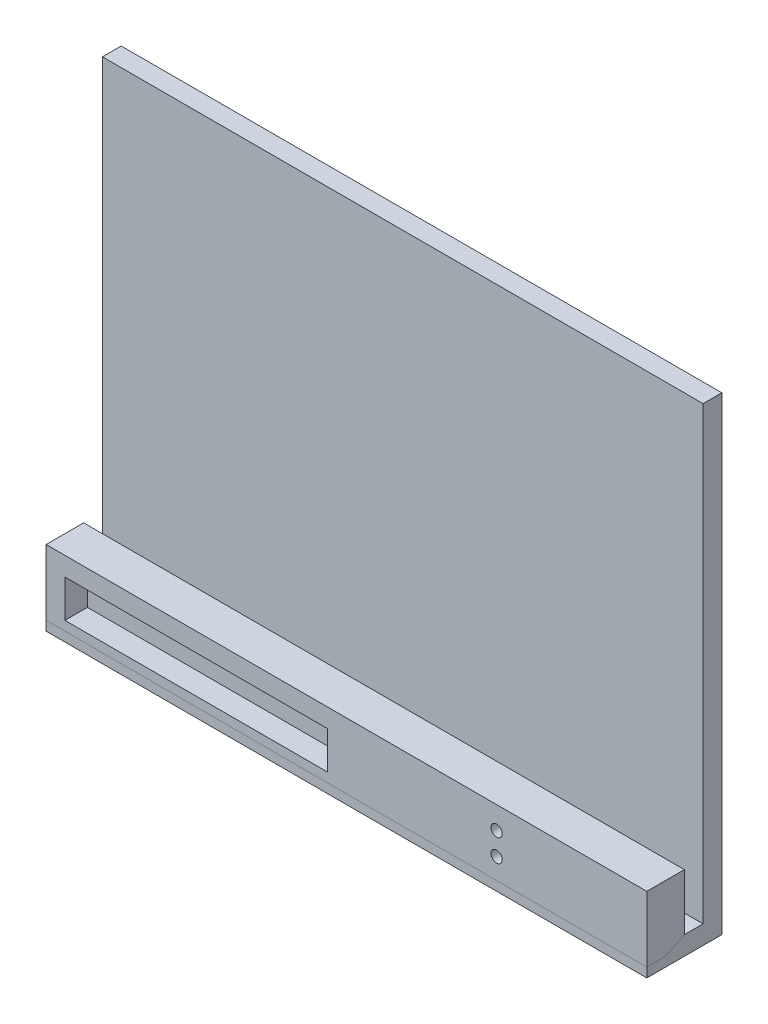
ISO-10303-21;
HEADER;
FILE_DESCRIPTION(('STEP AP214'),'2;1');
FILE_NAME('part.step','',(''),(''),'','','');
FILE_SCHEMA(('AUTOMOTIVE_DESIGN { 1 0 10303 214 1 1 1 1 }'));
ENDSEC;
DATA;
#1=APPLICATION_CONTEXT('core data for automotive mechanical design processes');
#2=APPLICATION_PROTOCOL_DEFINITION('international standard','automotive_design',2000,#1);
#3=PRODUCT_CONTEXT('',#1,'mechanical');
#4=PRODUCT('Part','Part','',(#3));
#5=PRODUCT_RELATED_PRODUCT_CATEGORY('part','',(#4));
#6=PRODUCT_DEFINITION_FORMATION('','',#4);
#7=PRODUCT_DEFINITION_CONTEXT('part definition',#1,'design');
#8=PRODUCT_DEFINITION('design','',#6,#7);
#9=PRODUCT_DEFINITION_SHAPE('','',#8);
#10=(LENGTH_UNIT() NAMED_UNIT(*) SI_UNIT(.MILLI.,.METRE.));
#11=(NAMED_UNIT(*) PLANE_ANGLE_UNIT() SI_UNIT($,.RADIAN.));
#12=(NAMED_UNIT(*) SI_UNIT($,.STERADIAN.) SOLID_ANGLE_UNIT());
#13=UNCERTAINTY_MEASURE_WITH_UNIT(LENGTH_MEASURE(1.E-05),#10,'distance_accuracy_value','');
#14=(GEOMETRIC_REPRESENTATION_CONTEXT(3) GLOBAL_UNCERTAINTY_ASSIGNED_CONTEXT((#13)) GLOBAL_UNIT_ASSIGNED_CONTEXT((#10,
#11,#12)) REPRESENTATION_CONTEXT('',''));
#15=CARTESIAN_POINT('',(0.,0.,0.));
#16=DIRECTION('',(0.,0.,1.));
#17=DIRECTION('',(1.,0.,0.));
#18=AXIS2_PLACEMENT_3D('',#15,#16,#17);
#19=CARTESIAN_POINT('',(-0.01000000000001,3.17499999999996,19.05));
#20=DIRECTION('',(0.,-0.894427190999916,-0.447213595499958));
#21=DIRECTION('',(0.,0.447213595499958,-0.894427190999916));
#22=AXIS2_PLACEMENT_3D('',#19,#20,#21);
#23=PLANE('',#22);
#24=DIRECTION('',(1.,0.,0.));
#25=VECTOR('',#24,1.);
#26=CARTESIAN_POINT('',(-0.01000000000001,3.17499999999996,19.05));
#27=LINE('',#26,#25);
#28=CARTESIAN_POINT('',(0.,3.17499999999995,19.05));
#29=VERTEX_POINT('',#28);
#30=CARTESIAN_POINT('',(203.2,3.17499999999998,19.05));
#31=VERTEX_POINT('',#30);
#32=EDGE_CURVE('E12',#29,#31,#27,.T.);
#33=ORIENTED_EDGE('',*,*,#32,.F.);
#34=DIRECTION('',(0.,0.447213595499958,-0.894427190999916));
#35=VECTOR('',#34,1.);
#36=CARTESIAN_POINT('',(0.,39.37,-53.34));
#37=LINE('',#36,#35);
#38=CARTESIAN_POINT('',(0.,6.35,12.7));
#39=VERTEX_POINT('',#38);
#40=EDGE_CURVE('E121',#29,#39,#37,.T.);
#41=ORIENTED_EDGE('',*,*,#40,.T.);
#42=DIRECTION('',(-1.,0.,0.));
#43=VECTOR('',#42,1.);
#44=CARTESIAN_POINT('',(0.,6.35,12.7));
#45=LINE('',#44,#43);
#46=CARTESIAN_POINT('',(203.2,6.35,12.7));
#47=VERTEX_POINT('',#46);
#48=EDGE_CURVE('E168',#47,#39,#45,.T.);
#49=ORIENTED_EDGE('',*,*,#48,.F.);
#50=DIRECTION('',(0.,-0.447213595499958,0.894427190999916));
#51=VECTOR('',#50,1.);
#52=CARTESIAN_POINT('',(203.2,39.37,-53.34));
#53=LINE('',#52,#51);
#54=EDGE_CURVE('E124',#47,#31,#53,.T.);
#55=ORIENTED_EDGE('',*,*,#54,.T.);
#56=EDGE_LOOP('',(#33,#41,#49,#55));
#57=FACE_BOUND('',#56,.T.);
#58=ADVANCED_FACE('F43',(#57),#23,.T.);
#59=CARTESIAN_POINT('',(-0.01000000000001,3.17499999999996,25.4));
#60=DIRECTION('',(0.,-1.,0.));
#61=DIRECTION('',(1.,0.,0.));
#62=AXIS2_PLACEMENT_3D('',#59,#60,#61);
#63=PLANE('',#62);
#64=DIRECTION('',(1.,0.,0.));
#65=VECTOR('',#64,1.);
#66=CARTESIAN_POINT('',(0.,3.17499999999996,25.4));
#67=LINE('',#66,#65);
#68=CARTESIAN_POINT('',(0.,3.17499999999998,25.4));
#69=VERTEX_POINT('',#68);
#70=CARTESIAN_POINT('',(203.2,3.17499999999998,25.4));
#71=VERTEX_POINT('',#70);
#72=EDGE_CURVE('E140',#69,#71,#67,.T.);
#73=ORIENTED_EDGE('',*,*,#72,.F.);
#74=DIRECTION('',(0.,0.,-1.));
#75=VECTOR('',#74,1.);
#76=CARTESIAN_POINT('',(0.,3.17499999999996,6.35));
#77=LINE('',#76,#75);
#78=EDGE_CURVE('E132',#69,#29,#77,.T.);
#79=ORIENTED_EDGE('',*,*,#78,.T.);
#80=ORIENTED_EDGE('',*,*,#32,.T.);
#81=DIRECTION('',(0.,0.,1.));
#82=VECTOR('',#81,1.);
#83=CARTESIAN_POINT('',(203.2,3.17499999999998,6.35));
#84=LINE('',#83,#82);
#85=EDGE_CURVE('E137',#31,#71,#84,.T.);
#86=ORIENTED_EDGE('',*,*,#85,.T.);
#87=EDGE_LOOP('',(#73,#79,#80,#86));
#88=FACE_BOUND('',#87,.T.);
#89=ADVANCED_FACE('F139',(#88),#63,.T.);
#90=CARTESIAN_POINT('',(0.,0.,17.78));
#91=DIRECTION('',(0.,0.,1.));
#92=DIRECTION('',(1.,0.,0.));
#93=AXIS2_PLACEMENT_3D('',#90,#91,#92);
#94=PLANE('',#93);
#95=DIRECTION('',(0.,-1.,0.));
#96=VECTOR('',#95,1.);
#97=CARTESIAN_POINT('',(6.35,19.05,17.78));
#98=LINE('',#97,#96);
#99=CARTESIAN_POINT('',(6.35,19.05,17.78));
#100=VERTEX_POINT('',#99);
#101=CARTESIAN_POINT('',(6.35,6.35,17.78));
#102=VERTEX_POINT('',#101);
#103=EDGE_CURVE('E178',#100,#102,#98,.T.);
#104=ORIENTED_EDGE('',*,*,#103,.T.);
#105=DIRECTION('',(1.,0.,0.));
#106=VECTOR('',#105,1.);
#107=CARTESIAN_POINT('',(6.35,6.35,17.78));
#108=LINE('',#107,#106);
#109=CARTESIAN_POINT('',(95.25,6.35,17.78));
#110=VERTEX_POINT('',#109);
#111=EDGE_CURVE('E190',#102,#110,#108,.T.);
#112=ORIENTED_EDGE('',*,*,#111,.T.);
#113=DIRECTION('',(0.,1.,0.));
#114=VECTOR('',#113,1.);
#115=CARTESIAN_POINT('',(95.25,19.05,17.78));
#116=LINE('',#115,#114);
#117=CARTESIAN_POINT('',(95.25,19.05,17.78));
#118=VERTEX_POINT('',#117);
#119=EDGE_CURVE('E187',#110,#118,#116,.T.);
#120=ORIENTED_EDGE('',*,*,#119,.T.);
#121=DIRECTION('',(-1.,0.,0.));
#122=VECTOR('',#121,1.);
#123=CARTESIAN_POINT('',(6.35,19.05,17.78));
#124=LINE('',#123,#122);
#125=EDGE_CURVE('E170',#118,#100,#124,.T.);
#126=ORIENTED_EDGE('',*,*,#125,.T.);
#127=EDGE_LOOP('',(#104,#112,#120,#126));
#128=FACE_BOUND('',#127,.T.);
#129=ADVANCED_FACE('F221',(#128),#94,.T.);
#130=CARTESIAN_POINT('',(6.35,6.35,17.78));
#131=DIRECTION('',(0.,-1.,0.));
#132=DIRECTION('',(0.,0.,-1.));
#133=AXIS2_PLACEMENT_3D('',#130,#131,#132);
#134=PLANE('',#133);
#135=DIRECTION('',(1.,0.,0.));
#136=VECTOR('',#135,1.);
#137=CARTESIAN_POINT('',(6.35,6.35,25.4));
#138=LINE('',#137,#136);
#139=CARTESIAN_POINT('',(6.35,6.35,25.4));
#140=VERTEX_POINT('',#139);
#141=CARTESIAN_POINT('',(95.25,6.35,25.4));
#142=VERTEX_POINT('',#141);
#143=EDGE_CURVE('E180',#140,#142,#138,.T.);
#144=ORIENTED_EDGE('',*,*,#143,.T.);
#145=DIRECTION('',(0.,0.,1.));
#146=VECTOR('',#145,1.);
#147=CARTESIAN_POINT('',(95.25,6.35,17.78));
#148=LINE('',#147,#146);
#149=EDGE_CURVE('E62',#110,#142,#148,.T.);
#150=ORIENTED_EDGE('',*,*,#149,.F.);
#151=ORIENTED_EDGE('',*,*,#111,.F.);
#152=DIRECTION('',(0.,0.,1.));
#153=VECTOR('',#152,1.);
#154=CARTESIAN_POINT('',(6.35,6.35,17.78));
#155=LINE('',#154,#153);
#156=EDGE_CURVE('E83',#102,#140,#155,.T.);
#157=ORIENTED_EDGE('',*,*,#156,.T.);
#158=EDGE_LOOP('',(#144,#150,#151,#157));
#159=FACE_BOUND('',#158,.T.);
#160=ADVANCED_FACE('F224',(#159),#134,.F.);
#161=CARTESIAN_POINT('',(95.25,19.05,17.78));
#162=DIRECTION('',(1.,0.,0.));
#163=DIRECTION('',(0.,0.,-1.));
#164=AXIS2_PLACEMENT_3D('',#161,#162,#163);
#165=PLANE('',#164);
#166=DIRECTION('',(0.,1.,0.));
#167=VECTOR('',#166,1.);
#168=CARTESIAN_POINT('',(95.25,19.05,25.4));
#169=LINE('',#168,#167);
#170=CARTESIAN_POINT('',(95.25,19.05,25.4));
#171=VERTEX_POINT('',#170);
#172=EDGE_CURVE('E177',#142,#171,#169,.T.);
#173=ORIENTED_EDGE('',*,*,#172,.T.);
#174=DIRECTION('',(0.,0.,1.));
#175=VECTOR('',#174,1.);
#176=CARTESIAN_POINT('',(95.25,19.05,17.78));
#177=LINE('',#176,#175);
#178=EDGE_CURVE('E172',#118,#171,#177,.T.);
#179=ORIENTED_EDGE('',*,*,#178,.F.);
#180=ORIENTED_EDGE('',*,*,#119,.F.);
#181=ORIENTED_EDGE('',*,*,#149,.T.);
#182=EDGE_LOOP('',(#173,#179,#180,#181));
#183=FACE_BOUND('',#182,.T.);
#184=ADVANCED_FACE('F230',(#183),#165,.F.);
#185=CARTESIAN_POINT('',(6.35,19.05,17.78));
#186=DIRECTION('',(0.,1.,0.));
#187=DIRECTION('',(0.,0.,1.));
#188=AXIS2_PLACEMENT_3D('',#185,#186,#187);
#189=PLANE('',#188);
#190=DIRECTION('',(-1.,0.,0.));
#191=VECTOR('',#190,1.);
#192=CARTESIAN_POINT('',(6.35,19.05,25.4));
#193=LINE('',#192,#191);
#194=CARTESIAN_POINT('',(6.35,19.05,25.4));
#195=VERTEX_POINT('',#194);
#196=EDGE_CURVE('E175',#171,#195,#193,.T.);
#197=ORIENTED_EDGE('',*,*,#196,.T.);
#198=DIRECTION('',(0.,0.,1.));
#199=VECTOR('',#198,1.);
#200=CARTESIAN_POINT('',(6.35,19.05,17.78));
#201=LINE('',#200,#199);
#202=EDGE_CURVE('E85',#100,#195,#201,.T.);
#203=ORIENTED_EDGE('',*,*,#202,.F.);
#204=ORIENTED_EDGE('',*,*,#125,.F.);
#205=ORIENTED_EDGE('',*,*,#178,.T.);
#206=EDGE_LOOP('',(#197,#203,#204,#205));
#207=FACE_BOUND('',#206,.T.);
#208=ADVANCED_FACE('F234',(#207),#189,.F.);
#209=CARTESIAN_POINT('',(6.35,19.05,17.78));
#210=DIRECTION('',(-1.,0.,0.));
#211=DIRECTION('',(0.,-1.,0.));
#212=AXIS2_PLACEMENT_3D('',#209,#210,#211);
#213=PLANE('',#212);
#214=DIRECTION('',(0.,-1.,0.));
#215=VECTOR('',#214,1.);
#216=CARTESIAN_POINT('',(6.35,19.05,25.4));
#217=LINE('',#216,#215);
#218=EDGE_CURVE('E182',#195,#140,#217,.T.);
#219=ORIENTED_EDGE('',*,*,#218,.T.);
#220=ORIENTED_EDGE('',*,*,#156,.F.);
#221=ORIENTED_EDGE('',*,*,#103,.F.);
#222=ORIENTED_EDGE('',*,*,#202,.T.);
#223=EDGE_LOOP('',(#219,#220,#221,#222));
#224=FACE_BOUND('',#223,.T.);
#225=ADVANCED_FACE('F247',(#224),#213,.F.);
#226=CARTESIAN_POINT('',(203.2,158.75,6.35));
#227=DIRECTION('',(-1.,0.,0.));
#228=DIRECTION('',(0.,-1.,0.));
#229=AXIS2_PLACEMENT_3D('',#226,#227,#228);
#230=PLANE('',#229);
#231=ORIENTED_EDGE('',*,*,#85,.F.);
#232=ORIENTED_EDGE('',*,*,#54,.F.);
#233=DIRECTION('',(0.,-1.,0.));
#234=VECTOR('',#233,1.);
#235=CARTESIAN_POINT('',(203.2,25.4,12.7));
#236=LINE('',#235,#234);
#237=CARTESIAN_POINT('',(203.2,25.4,12.7));
#238=VERTEX_POINT('',#237);
#239=EDGE_CURVE('E151',#238,#47,#236,.T.);
#240=ORIENTED_EDGE('',*,*,#239,.F.);
#241=DIRECTION('',(0.,0.,-1.));
#242=VECTOR('',#241,1.);
#243=CARTESIAN_POINT('',(203.2,25.4,25.4));
#244=LINE('',#243,#242);
#245=CARTESIAN_POINT('',(203.2,25.4,25.4));
#246=VERTEX_POINT('',#245);
#247=EDGE_CURVE('E161',#246,#238,#244,.T.);
#248=ORIENTED_EDGE('',*,*,#247,.F.);
#249=DIRECTION('',(0.,1.,0.));
#250=VECTOR('',#249,1.);
#251=CARTESIAN_POINT('',(203.2,6.35,25.4));
#252=LINE('',#251,#250);
#253=EDGE_CURVE('E142',#71,#246,#252,.T.);
#254=ORIENTED_EDGE('',*,*,#253,.F.);
#255=EDGE_LOOP('',(#231,#232,#240,#248,#254));
#256=FACE_BOUND('',#255,.T.);
#257=ADVANCED_FACE('F206',(#256),#230,.F.);
#258=CARTESIAN_POINT('',(0.,25.4,0.));
#259=DIRECTION('',(0.,-1.,0.));
#260=DIRECTION('',(0.,0.,-1.));
#261=AXIS2_PLACEMENT_3D('',#258,#259,#260);
#262=PLANE('',#261);
#263=DIRECTION('',(0.,0.,1.));
#264=VECTOR('',#263,1.);
#265=CARTESIAN_POINT('',(0.,25.4,25.4));
#266=LINE('',#265,#264);
#267=CARTESIAN_POINT('',(0.,25.4,12.7));
#268=VERTEX_POINT('',#267);
#269=CARTESIAN_POINT('',(0.,25.4,25.4));
#270=VERTEX_POINT('',#269);
#271=EDGE_CURVE('E165',#268,#270,#266,.T.);
#272=ORIENTED_EDGE('',*,*,#271,.T.);
#273=DIRECTION('',(1.,0.,0.));
#274=VECTOR('',#273,1.);
#275=CARTESIAN_POINT('',(0.,25.4,25.4));
#276=LINE('',#275,#274);
#277=EDGE_CURVE('E163',#270,#246,#276,.T.);
#278=ORIENTED_EDGE('',*,*,#277,.T.);
#279=ORIENTED_EDGE('',*,*,#247,.T.);
#280=DIRECTION('',(-1.,0.,0.));
#281=VECTOR('',#280,1.);
#282=CARTESIAN_POINT('',(0.,25.4,12.7));
#283=LINE('',#282,#281);
#284=EDGE_CURVE('E157',#238,#268,#283,.T.);
#285=ORIENTED_EDGE('',*,*,#284,.T.);
#286=EDGE_LOOP('',(#272,#278,#279,#285));
#287=FACE_BOUND('',#286,.T.);
#288=ADVANCED_FACE('F209',(#287),#262,.F.);
#289=CARTESIAN_POINT('',(0.,158.75,6.35));
#290=DIRECTION('',(1.,0.,0.));
#291=DIRECTION('',(0.,1.,0.));
#292=AXIS2_PLACEMENT_3D('',#289,#290,#291);
#293=PLANE('',#292);
#294=ORIENTED_EDGE('',*,*,#78,.F.);
#295=DIRECTION('',(0.,-1.,0.));
#296=VECTOR('',#295,1.);
#297=CARTESIAN_POINT('',(0.,6.35,25.4));
#298=LINE('',#297,#296);
#299=EDGE_CURVE('E47',#270,#69,#298,.T.);
#300=ORIENTED_EDGE('',*,*,#299,.F.);
#301=ORIENTED_EDGE('',*,*,#271,.F.);
#302=DIRECTION('',(0.,-1.,0.));
#303=VECTOR('',#302,1.);
#304=CARTESIAN_POINT('',(0.,25.4,12.7));
#305=LINE('',#304,#303);
#306=EDGE_CURVE('E136',#268,#39,#305,.T.);
#307=ORIENTED_EDGE('',*,*,#306,.T.);
#308=ORIENTED_EDGE('',*,*,#40,.F.);
#309=EDGE_LOOP('',(#294,#300,#301,#307,#308));
#310=FACE_BOUND('',#309,.T.);
#311=ADVANCED_FACE('F131',(#310),#293,.F.);
#312=CARTESIAN_POINT('',(152.4,10.16,-0.001000000000001));
#313=DIRECTION('',(0.,0.,1.));
#314=DIRECTION('',(1.,0.,0.));
#315=AXIS2_PLACEMENT_3D('',#312,#313,#314);
#316=CYLINDRICAL_SURFACE('',#315,1.90499999999999);
#317=CARTESIAN_POINT('',(152.4,10.16,25.4));
#318=DIRECTION('',(0.,0.,1.));
#319=DIRECTION('',(1.,0.,0.));
#320=AXIS2_PLACEMENT_3D('',#317,#318,#319);
#321=CIRCLE('',#320,1.90499999999999);
#322=CARTESIAN_POINT('',(154.305,10.16,25.4));
#323=VERTEX_POINT('',#322);
#324=EDGE_CURVE('E195',#323,#323,#321,.T.);
#325=CARTESIAN_POINT('',(152.4,10.16,12.7));
#326=DIRECTION('',(0.,0.,1.));
#327=DIRECTION('',(1.,0.,0.));
#328=AXIS2_PLACEMENT_3D('',#325,#326,#327);
#329=CIRCLE('',#328,1.90499999999999);
#330=CARTESIAN_POINT('',(154.305,10.16,12.7));
#331=VERTEX_POINT('',#330);
#332=EDGE_CURVE('E53',#331,#331,#329,.F.);
#333=CARTESIAN_POINT('',(154.305,10.16,25.4));
#334=CARTESIAN_POINT('',(154.305,10.16,25.2677083333333));
#335=CARTESIAN_POINT('',(154.305,10.16,25.1354166666667));
#336=CARTESIAN_POINT('',(154.305,10.16,24.8708333333333));
#337=CARTESIAN_POINT('',(154.305,10.16,24.7385416666667));
#338=CARTESIAN_POINT('',(154.305,10.16,24.4739583333333));
#339=CARTESIAN_POINT('',(154.305,10.16,24.3416666666667));
#340=CARTESIAN_POINT('',(154.305,10.16,24.0770833333333));
#341=CARTESIAN_POINT('',(154.305,10.16,23.9447916666667));
#342=CARTESIAN_POINT('',(154.305,10.16,23.6802083333333));
#343=CARTESIAN_POINT('',(154.305,10.16,23.5479166666667));
#344=CARTESIAN_POINT('',(154.305,10.16,23.2833333333333));
#345=CARTESIAN_POINT('',(154.305,10.16,23.1510416666667));
#346=CARTESIAN_POINT('',(154.305,10.16,22.8864583333333));
#347=CARTESIAN_POINT('',(154.305,10.16,22.7541666666667));
#348=CARTESIAN_POINT('',(154.305,10.16,22.4895833333333));
#349=CARTESIAN_POINT('',(154.305,10.16,22.3572916666667));
#350=CARTESIAN_POINT('',(154.305,10.16,22.0927083333333));
#351=CARTESIAN_POINT('',(154.305,10.16,21.9604166666667));
#352=CARTESIAN_POINT('',(154.305,10.16,21.6958333333333));
#353=CARTESIAN_POINT('',(154.305,10.16,21.5635416666667));
#354=CARTESIAN_POINT('',(154.305,10.16,21.2989583333333));
#355=CARTESIAN_POINT('',(154.305,10.16,21.1666666666667));
#356=CARTESIAN_POINT('',(154.305,10.16,20.9020833333333));
#357=CARTESIAN_POINT('',(154.305,10.16,20.7697916666667));
#358=CARTESIAN_POINT('',(154.305,10.16,20.5052083333333));
#359=CARTESIAN_POINT('',(154.305,10.16,20.3729166666667));
#360=CARTESIAN_POINT('',(154.305,10.16,20.1083333333333));
#361=CARTESIAN_POINT('',(154.305,10.16,19.9760416666667));
#362=CARTESIAN_POINT('',(154.305,10.16,19.7114583333333));
#363=CARTESIAN_POINT('',(154.305,10.16,19.5791666666667));
#364=CARTESIAN_POINT('',(154.305,10.16,19.3145833333333));
#365=CARTESIAN_POINT('',(154.305,10.16,19.1822916666667));
#366=CARTESIAN_POINT('',(154.305,10.16,18.9177083333333));
#367=CARTESIAN_POINT('',(154.305,10.16,18.7854166666667));
#368=CARTESIAN_POINT('',(154.305,10.16,18.5208333333333));
#369=CARTESIAN_POINT('',(154.305,10.16,18.3885416666667));
#370=CARTESIAN_POINT('',(154.305,10.16,18.1239583333333));
#371=CARTESIAN_POINT('',(154.305,10.16,17.9916666666667));
#372=CARTESIAN_POINT('',(154.305,10.16,17.7270833333333));
#373=CARTESIAN_POINT('',(154.305,10.16,17.5947916666667));
#374=CARTESIAN_POINT('',(154.305,10.16,17.3302083333333));
#375=CARTESIAN_POINT('',(154.305,10.16,17.1979166666667));
#376=CARTESIAN_POINT('',(154.305,10.16,16.9333333333333));
#377=CARTESIAN_POINT('',(154.305,10.16,16.8010416666667));
#378=CARTESIAN_POINT('',(154.305,10.16,16.5364583333333));
#379=CARTESIAN_POINT('',(154.305,10.16,16.4041666666667));
#380=CARTESIAN_POINT('',(154.305,10.16,16.1395833333333));
#381=CARTESIAN_POINT('',(154.305,10.16,16.0072916666667));
#382=CARTESIAN_POINT('',(154.305,10.16,15.7427083333333));
#383=CARTESIAN_POINT('',(154.305,10.16,15.6104166666667));
#384=CARTESIAN_POINT('',(154.305,10.16,15.3458333333333));
#385=CARTESIAN_POINT('',(154.305,10.16,15.2135416666667));
#386=CARTESIAN_POINT('',(154.305,10.16,14.9489583333333));
#387=CARTESIAN_POINT('',(154.305,10.16,14.8166666666667));
#388=CARTESIAN_POINT('',(154.305,10.16,14.5520833333333));
#389=CARTESIAN_POINT('',(154.305,10.16,14.4197916666667));
#390=CARTESIAN_POINT('',(154.305,10.16,14.1552083333333));
#391=CARTESIAN_POINT('',(154.305,10.16,14.0229166666667));
#392=CARTESIAN_POINT('',(154.305,10.16,13.7583333333333));
#393=CARTESIAN_POINT('',(154.305,10.16,13.6260416666667));
#394=CARTESIAN_POINT('',(154.305,10.16,13.3614583333333));
#395=CARTESIAN_POINT('',(154.305,10.16,13.2291666666667));
#396=CARTESIAN_POINT('',(154.305,10.16,12.9645833333333));
#397=CARTESIAN_POINT('',(154.305,10.16,12.8322916666667));
#398=CARTESIAN_POINT('',(154.305,10.16,12.7));
#399=B_SPLINE_CURVE_WITH_KNOTS('',3,(#333,#334,#335,#336,#337,#338,#339,#340,#341,#342,#343,
#344,#345,#346,#347,#348,#349,#350,#351,#352,#353,#354,#355,#356,#357,#358,#359,#360,#361,#362,
#363,#364,#365,#366,#367,#368,#369,#370,#371,#372,#373,#374,#375,#376,#377,#378,#379,#380,#381,
#382,#383,#384,#385,#386,#387,#388,#389,#390,#391,#392,#393,#394,#395,#396,#397,#398),
.UNSPECIFIED.,.F.,.F.,(4,2,2,2,2,2,2,2,2,2,2,2,2,2,2,2,2,2,2,2,2,2,2,2,2,2,2,2,2,2,2,2,4),(0.,
0.396875000000001,0.793749999999999,1.190625,1.5875,1.984375,2.38125,2.778125,3.175,3.571875,
3.96875,4.365625,4.7625,5.159375,5.55625,5.953125,6.35,6.746875,7.14375,7.540625,7.9375,
8.334375,8.73125,9.128125,9.525,9.921875,10.31875,10.715625,11.1125,11.509375,11.90625,
12.303125,12.7),.UNSPECIFIED.);
#400=EDGE_CURVE('BSEAM236',#323,#331,#399,.T.);
#401=ORIENTED_EDGE('',*,*,#324,.T.);
#402=ORIENTED_EDGE('',*,*,#332,.T.);
#403=ORIENTED_EDGE('',*,*,#400,.T.);
#404=ORIENTED_EDGE('',*,*,#400,.F.);
#405=EDGE_LOOP('',(#401,#403,#402,#404));
#406=FACE_BOUND('',#405,.T.);
#407=ADVANCED_FACE('F236',(#406),#316,.F.);
#408=CARTESIAN_POINT('',(152.4,17.78,-0.001000000000001));
#409=DIRECTION('',(0.,0.,1.));
#410=DIRECTION('',(1.,0.,0.));
#411=AXIS2_PLACEMENT_3D('',#408,#409,#410);
#412=CYLINDRICAL_SURFACE('',#411,1.90499999999999);
#413=CARTESIAN_POINT('',(152.4,17.78,25.4));
#414=DIRECTION('',(0.,0.,1.));
#415=DIRECTION('',(1.,0.,0.));
#416=AXIS2_PLACEMENT_3D('',#413,#414,#415);
#417=CIRCLE('',#416,1.90499999999999);
#418=CARTESIAN_POINT('',(154.305,17.78,25.4));
#419=VERTEX_POINT('',#418);
#420=EDGE_CURVE('E184',#419,#419,#417,.T.);
#421=CARTESIAN_POINT('',(152.4,17.78,12.7));
#422=DIRECTION('',(0.,0.,1.));
#423=DIRECTION('',(1.,0.,0.));
#424=AXIS2_PLACEMENT_3D('',#421,#422,#423);
#425=CIRCLE('',#424,1.90499999999999);
#426=CARTESIAN_POINT('',(154.305,17.78,12.7));
#427=VERTEX_POINT('',#426);
#428=EDGE_CURVE('E198',#427,#427,#425,.F.);
#429=CARTESIAN_POINT('',(154.305,17.78,25.4));
#430=CARTESIAN_POINT('',(154.305,17.78,25.2677083333333));
#431=CARTESIAN_POINT('',(154.305,17.78,25.1354166666667));
#432=CARTESIAN_POINT('',(154.305,17.78,24.8708333333333));
#433=CARTESIAN_POINT('',(154.305,17.78,24.7385416666667));
#434=CARTESIAN_POINT('',(154.305,17.78,24.4739583333333));
#435=CARTESIAN_POINT('',(154.305,17.78,24.3416666666667));
#436=CARTESIAN_POINT('',(154.305,17.78,24.0770833333333));
#437=CARTESIAN_POINT('',(154.305,17.78,23.9447916666667));
#438=CARTESIAN_POINT('',(154.305,17.78,23.6802083333333));
#439=CARTESIAN_POINT('',(154.305,17.78,23.5479166666667));
#440=CARTESIAN_POINT('',(154.305,17.78,23.2833333333333));
#441=CARTESIAN_POINT('',(154.305,17.78,23.1510416666667));
#442=CARTESIAN_POINT('',(154.305,17.78,22.8864583333333));
#443=CARTESIAN_POINT('',(154.305,17.78,22.7541666666667));
#444=CARTESIAN_POINT('',(154.305,17.78,22.4895833333333));
#445=CARTESIAN_POINT('',(154.305,17.78,22.3572916666667));
#446=CARTESIAN_POINT('',(154.305,17.78,22.0927083333333));
#447=CARTESIAN_POINT('',(154.305,17.78,21.9604166666667));
#448=CARTESIAN_POINT('',(154.305,17.78,21.6958333333333));
#449=CARTESIAN_POINT('',(154.305,17.78,21.5635416666667));
#450=CARTESIAN_POINT('',(154.305,17.78,21.2989583333333));
#451=CARTESIAN_POINT('',(154.305,17.78,21.1666666666667));
#452=CARTESIAN_POINT('',(154.305,17.78,20.9020833333333));
#453=CARTESIAN_POINT('',(154.305,17.78,20.7697916666667));
#454=CARTESIAN_POINT('',(154.305,17.78,20.5052083333333));
#455=CARTESIAN_POINT('',(154.305,17.78,20.3729166666667));
#456=CARTESIAN_POINT('',(154.305,17.78,20.1083333333333));
#457=CARTESIAN_POINT('',(154.305,17.78,19.9760416666667));
#458=CARTESIAN_POINT('',(154.305,17.78,19.7114583333333));
#459=CARTESIAN_POINT('',(154.305,17.78,19.5791666666667));
#460=CARTESIAN_POINT('',(154.305,17.78,19.3145833333333));
#461=CARTESIAN_POINT('',(154.305,17.78,19.1822916666667));
#462=CARTESIAN_POINT('',(154.305,17.78,18.9177083333333));
#463=CARTESIAN_POINT('',(154.305,17.78,18.7854166666667));
#464=CARTESIAN_POINT('',(154.305,17.78,18.5208333333333));
#465=CARTESIAN_POINT('',(154.305,17.78,18.3885416666667));
#466=CARTESIAN_POINT('',(154.305,17.78,18.1239583333333));
#467=CARTESIAN_POINT('',(154.305,17.78,17.9916666666667));
#468=CARTESIAN_POINT('',(154.305,17.78,17.7270833333333));
#469=CARTESIAN_POINT('',(154.305,17.78,17.5947916666667));
#470=CARTESIAN_POINT('',(154.305,17.78,17.3302083333333));
#471=CARTESIAN_POINT('',(154.305,17.78,17.1979166666667));
#472=CARTESIAN_POINT('',(154.305,17.78,16.9333333333333));
#473=CARTESIAN_POINT('',(154.305,17.78,16.8010416666667));
#474=CARTESIAN_POINT('',(154.305,17.78,16.5364583333333));
#475=CARTESIAN_POINT('',(154.305,17.78,16.4041666666667));
#476=CARTESIAN_POINT('',(154.305,17.78,16.1395833333333));
#477=CARTESIAN_POINT('',(154.305,17.78,16.0072916666667));
#478=CARTESIAN_POINT('',(154.305,17.78,15.7427083333333));
#479=CARTESIAN_POINT('',(154.305,17.78,15.6104166666667));
#480=CARTESIAN_POINT('',(154.305,17.78,15.3458333333333));
#481=CARTESIAN_POINT('',(154.305,17.78,15.2135416666667));
#482=CARTESIAN_POINT('',(154.305,17.78,14.9489583333333));
#483=CARTESIAN_POINT('',(154.305,17.78,14.8166666666667));
#484=CARTESIAN_POINT('',(154.305,17.78,14.5520833333333));
#485=CARTESIAN_POINT('',(154.305,17.78,14.4197916666667));
#486=CARTESIAN_POINT('',(154.305,17.78,14.1552083333333));
#487=CARTESIAN_POINT('',(154.305,17.78,14.0229166666667));
#488=CARTESIAN_POINT('',(154.305,17.78,13.7583333333333));
#489=CARTESIAN_POINT('',(154.305,17.78,13.6260416666667));
#490=CARTESIAN_POINT('',(154.305,17.78,13.3614583333333));
#491=CARTESIAN_POINT('',(154.305,17.78,13.2291666666667));
#492=CARTESIAN_POINT('',(154.305,17.78,12.9645833333333));
#493=CARTESIAN_POINT('',(154.305,17.78,12.8322916666667));
#494=CARTESIAN_POINT('',(154.305,17.78,12.7));
#495=B_SPLINE_CURVE_WITH_KNOTS('',3,(#429,#430,#431,#432,#433,#434,#435,#436,#437,#438,#439,
#440,#441,#442,#443,#444,#445,#446,#447,#448,#449,#450,#451,#452,#453,#454,#455,#456,#457,#458,
#459,#460,#461,#462,#463,#464,#465,#466,#467,#468,#469,#470,#471,#472,#473,#474,#475,#476,#477,
#478,#479,#480,#481,#482,#483,#484,#485,#486,#487,#488,#489,#490,#491,#492,#493,#494),
.UNSPECIFIED.,.F.,.F.,(4,2,2,2,2,2,2,2,2,2,2,2,2,2,2,2,2,2,2,2,2,2,2,2,2,2,2,2,2,2,2,2,4),(0.,
0.396875000000001,0.793749999999999,1.190625,1.5875,1.984375,2.38125,2.778125,3.175,3.571875,
3.96875,4.365625,4.7625,5.159375,5.55625,5.953125,6.35,6.746875,7.14375,7.540625,7.9375,
8.334375,8.73125,9.128125,9.525,9.921875,10.31875,10.715625,11.1125,11.509375,11.90625,
12.303125,12.7),.UNSPECIFIED.);
#496=EDGE_CURVE('BSEAM215',#419,#427,#495,.T.);
#497=ORIENTED_EDGE('',*,*,#420,.T.);
#498=ORIENTED_EDGE('',*,*,#428,.T.);
#499=ORIENTED_EDGE('',*,*,#496,.T.);
#500=ORIENTED_EDGE('',*,*,#496,.F.);
#501=EDGE_LOOP('',(#497,#499,#498,#500));
#502=FACE_BOUND('',#501,.T.);
#503=ADVANCED_FACE('F215',(#502),#412,.F.);
#504=CARTESIAN_POINT('',(0.,25.4,12.7));
#505=DIRECTION('',(0.,0.,1.));
#506=DIRECTION('',(1.,0.,0.));
#507=AXIS2_PLACEMENT_3D('',#504,#505,#506);
#508=PLANE('',#507);
#509=ORIENTED_EDGE('',*,*,#428,.F.);
#510=EDGE_LOOP('',(#509));
#511=FACE_BOUND('',#510,.T.);
#512=ORIENTED_EDGE('',*,*,#332,.F.);
#513=EDGE_LOOP('',(#512));
#514=FACE_BOUND('',#513,.T.);
#515=ORIENTED_EDGE('',*,*,#48,.T.);
#516=ORIENTED_EDGE('',*,*,#306,.F.);
#517=ORIENTED_EDGE('',*,*,#284,.F.);
#518=ORIENTED_EDGE('',*,*,#239,.T.);
#519=EDGE_LOOP('',(#515,#516,#517,#518));
#520=FACE_BOUND('',#519,.T.);
#521=ADVANCED_FACE('F204',(#511,#514,#520),#508,.F.);
#522=CARTESIAN_POINT('',(0.,0.,25.4));
#523=DIRECTION('',(0.,0.,1.));
#524=DIRECTION('',(1.,0.,0.));
#525=AXIS2_PLACEMENT_3D('',#522,#523,#524);
#526=PLANE('',#525);
#527=ORIENTED_EDGE('',*,*,#420,.F.);
#528=EDGE_LOOP('',(#527));
#529=FACE_BOUND('',#528,.T.);
#530=ORIENTED_EDGE('',*,*,#324,.F.);
#531=EDGE_LOOP('',(#530));
#532=FACE_BOUND('',#531,.T.);
#533=ORIENTED_EDGE('',*,*,#218,.F.);
#534=ORIENTED_EDGE('',*,*,#196,.F.);
#535=ORIENTED_EDGE('',*,*,#172,.F.);
#536=ORIENTED_EDGE('',*,*,#143,.F.);
#537=EDGE_LOOP('',(#533,#534,#535,#536));
#538=FACE_BOUND('',#537,.T.);
#539=ORIENTED_EDGE('',*,*,#299,.T.);
#540=ORIENTED_EDGE('',*,*,#72,.T.);
#541=ORIENTED_EDGE('',*,*,#253,.T.);
#542=ORIENTED_EDGE('',*,*,#277,.F.);
#543=EDGE_LOOP('',(#539,#540,#541,#542));
#544=FACE_BOUND('',#543,.T.);
#545=ADVANCED_FACE('F45',(#529,#532,#538,#544),#526,.T.);
#546=CLOSED_SHELL('',(#58,#89,#129,#160,#184,#208,#225,#257,#288,#311,#407,#503,#521,#545));
#547=MANIFOLD_SOLID_BREP('B2',#546);
#548=CARTESIAN_POINT('',(-0.01000000000001,3.17499999999996,19.05));
#549=DIRECTION('',(0.,-0.894427190999916,-0.447213595499958));
#550=DIRECTION('',(0.,0.447213595499958,-0.894427190999916));
#551=AXIS2_PLACEMENT_3D('',#548,#549,#550);
#552=PLANE('',#551);
#553=DIRECTION('',(1.,0.,0.));
#554=VECTOR('',#553,1.);
#555=CARTESIAN_POINT('',(-0.01000000000001,3.17499999999996,19.05));
#556=LINE('',#555,#554);
#557=CARTESIAN_POINT('',(0.,3.17499999999995,19.05));
#558=VERTEX_POINT('',#557);
#559=CARTESIAN_POINT('',(203.2,3.17499999999998,19.05));
#560=VERTEX_POINT('',#559);
#561=EDGE_CURVE('E41',#558,#560,#556,.T.);
#562=ORIENTED_EDGE('',*,*,#561,.T.);
#563=DIRECTION('',(0.,-0.447213595499958,0.894427190999916));
#564=VECTOR('',#563,1.);
#565=CARTESIAN_POINT('',(203.2,39.37,-53.34));
#566=LINE('',#565,#564);
#567=CARTESIAN_POINT('',(203.2,6.35,12.7));
#568=VERTEX_POINT('',#567);
#569=EDGE_CURVE('E451',#568,#560,#566,.T.);
#570=ORIENTED_EDGE('',*,*,#569,.F.);
#571=DIRECTION('',(-1.,0.,0.));
#572=VECTOR('',#571,1.);
#573=CARTESIAN_POINT('',(0.,6.35,12.7));
#574=LINE('',#573,#572);
#575=CARTESIAN_POINT('',(0.,6.35,12.7));
#576=VERTEX_POINT('',#575);
#577=EDGE_CURVE('E374',#568,#576,#574,.T.);
#578=ORIENTED_EDGE('',*,*,#577,.T.);
#579=DIRECTION('',(0.,0.447213595499958,-0.894427190999916));
#580=VECTOR('',#579,1.);
#581=CARTESIAN_POINT('',(0.,39.37,-53.34));
#582=LINE('',#581,#580);
#583=EDGE_CURVE('E389',#558,#576,#582,.T.);
#584=ORIENTED_EDGE('',*,*,#583,.F.);
#585=EDGE_LOOP('',(#562,#570,#578,#584));
#586=FACE_BOUND('',#585,.T.);
#587=ADVANCED_FACE('F365',(#586),#552,.F.);
#588=CARTESIAN_POINT('',(-0.01000000000001,3.17499999999996,25.4));
#589=DIRECTION('',(0.,-1.,0.));
#590=DIRECTION('',(1.,0.,0.));
#591=AXIS2_PLACEMENT_3D('',#588,#589,#590);
#592=PLANE('',#591);
#593=DIRECTION('',(1.,0.,0.));
#594=VECTOR('',#593,1.);
#595=CARTESIAN_POINT('',(0.,3.17499999999996,25.4));
#596=LINE('',#595,#594);
#597=CARTESIAN_POINT('',(0.,3.17499999999998,25.4));
#598=VERTEX_POINT('',#597);
#599=CARTESIAN_POINT('',(203.2,3.17499999999998,25.4));
#600=VERTEX_POINT('',#599);
#601=EDGE_CURVE('E440',#598,#600,#596,.T.);
#602=ORIENTED_EDGE('',*,*,#601,.T.);
#603=DIRECTION('',(0.,0.,1.));
#604=VECTOR('',#603,1.);
#605=CARTESIAN_POINT('',(203.2,3.17499999999998,6.35));
#606=LINE('',#605,#604);
#607=EDGE_CURVE('E489',#560,#600,#606,.T.);
#608=ORIENTED_EDGE('',*,*,#607,.F.);
#609=ORIENTED_EDGE('',*,*,#561,.F.);
#610=DIRECTION('',(0.,0.,-1.));
#611=VECTOR('',#610,1.);
#612=CARTESIAN_POINT('',(0.,3.17499999999996,6.35));
#613=LINE('',#612,#611);
#614=EDGE_CURVE('E369',#598,#558,#613,.T.);
#615=ORIENTED_EDGE('',*,*,#614,.F.);
#616=EDGE_LOOP('',(#602,#608,#609,#615));
#617=FACE_BOUND('',#616,.T.);
#618=ADVANCED_FACE('F367',(#617),#592,.F.);
#619=CARTESIAN_POINT('',(0.,6.35,25.4));
#620=DIRECTION('',(0.,-1.,0.));
#621=DIRECTION('',(0.,0.,-1.));
#622=AXIS2_PLACEMENT_3D('',#619,#620,#621);
#623=PLANE('',#622);
#624=ORIENTED_EDGE('',*,*,#577,.F.);
#625=DIRECTION('',(0.,0.,-1.));
#626=VECTOR('',#625,1.);
#627=CARTESIAN_POINT('',(203.2,6.35,25.4));
#628=LINE('',#627,#626);
#629=CARTESIAN_POINT('',(203.2,6.35000000000005,6.35));
#630=VERTEX_POINT('',#629);
#631=EDGE_CURVE('E465',#568,#630,#628,.T.);
#632=ORIENTED_EDGE('',*,*,#631,.T.);
#633=DIRECTION('',(-1.,0.,0.));
#634=VECTOR('',#633,1.);
#635=CARTESIAN_POINT('',(0.,6.35,6.35));
#636=LINE('',#635,#634);
#637=CARTESIAN_POINT('',(0.,6.35,6.35));
#638=VERTEX_POINT('',#637);
#639=EDGE_CURVE('E441',#630,#638,#636,.T.);
#640=ORIENTED_EDGE('',*,*,#639,.T.);
#641=DIRECTION('',(0.,0.,-1.));
#642=VECTOR('',#641,1.);
#643=CARTESIAN_POINT('',(0.,6.35,25.4));
#644=LINE('',#643,#642);
#645=EDGE_CURVE('E458',#576,#638,#644,.T.);
#646=ORIENTED_EDGE('',*,*,#645,.F.);
#647=EDGE_LOOP('',(#624,#632,#640,#646));
#648=FACE_BOUND('',#647,.T.);
#649=ADVANCED_FACE('F495',(#648),#623,.F.);
#650=CARTESIAN_POINT('',(0.,158.75,6.35));
#651=DIRECTION('',(1.,0.,0.));
#652=DIRECTION('',(0.,1.,0.));
#653=AXIS2_PLACEMENT_3D('',#650,#651,#652);
#654=PLANE('',#653);
#655=DIRECTION('',(0.,-1.,0.));
#656=VECTOR('',#655,1.);
#657=CARTESIAN_POINT('',(0.,6.35,25.4));
#658=LINE('',#657,#656);
#659=CARTESIAN_POINT('',(0.,0.,25.4));
#660=VERTEX_POINT('',#659);
#661=EDGE_CURVE('E432',#598,#660,#658,.T.);
#662=ORIENTED_EDGE('',*,*,#661,.F.);
#663=ORIENTED_EDGE('',*,*,#614,.T.);
#664=ORIENTED_EDGE('',*,*,#583,.T.);
#665=ORIENTED_EDGE('',*,*,#645,.T.);
#666=DIRECTION('',(0.,-1.,0.));
#667=VECTOR('',#666,1.);
#668=CARTESIAN_POINT('',(0.,158.75,6.35));
#669=LINE('',#668,#667);
#670=CARTESIAN_POINT('',(0.,158.75,6.35));
#671=VERTEX_POINT('',#670);
#672=EDGE_CURVE('E467',#671,#638,#669,.T.);
#673=ORIENTED_EDGE('',*,*,#672,.F.);
#674=DIRECTION('',(0.,0.,-1.));
#675=VECTOR('',#674,1.);
#676=CARTESIAN_POINT('',(0.,158.75,6.35));
#677=LINE('',#676,#675);
#678=CARTESIAN_POINT('',(0.,158.75,0.));
#679=VERTEX_POINT('',#678);
#680=EDGE_CURVE('E475',#671,#679,#677,.T.);
#681=ORIENTED_EDGE('',*,*,#680,.T.);
#682=DIRECTION('',(0.,-1.,0.));
#683=VECTOR('',#682,1.);
#684=CARTESIAN_POINT('',(0.,158.75,0.));
#685=LINE('',#684,#683);
#686=CARTESIAN_POINT('',(0.,0.,0.));
#687=VERTEX_POINT('',#686);
#688=EDGE_CURVE('E449',#679,#687,#685,.T.);
#689=ORIENTED_EDGE('',*,*,#688,.T.);
#690=DIRECTION('',(0.,0.,-1.));
#691=VECTOR('',#690,1.);
#692=CARTESIAN_POINT('',(0.,0.,6.35));
#693=LINE('',#692,#691);
#694=EDGE_CURVE('E445',#660,#687,#693,.T.);
#695=ORIENTED_EDGE('',*,*,#694,.F.);
#696=EDGE_LOOP('',(#662,#663,#664,#665,#673,#681,#689,#695));
#697=FACE_BOUND('',#696,.T.);
#698=ADVANCED_FACE('F446',(#697),#654,.F.);
#699=CARTESIAN_POINT('',(0.,0.,6.35));
#700=DIRECTION('',(0.,1.,0.));
#701=DIRECTION('',(0.,0.,1.));
#702=AXIS2_PLACEMENT_3D('',#699,#700,#701);
#703=PLANE('',#702);
#704=DIRECTION('',(1.,0.,0.));
#705=VECTOR('',#704,1.);
#706=CARTESIAN_POINT('',(0.,0.,0.));
#707=LINE('',#706,#705);
#708=CARTESIAN_POINT('',(203.2,0.,0.));
#709=VERTEX_POINT('',#708);
#710=EDGE_CURVE('E477',#687,#709,#707,.T.);
#711=ORIENTED_EDGE('',*,*,#710,.T.);
#712=DIRECTION('',(0.,0.,-1.));
#713=VECTOR('',#712,1.);
#714=CARTESIAN_POINT('',(203.2,0.,6.35));
#715=LINE('',#714,#713);
#716=CARTESIAN_POINT('',(203.2,0.,25.4));
#717=VERTEX_POINT('',#716);
#718=EDGE_CURVE('E452',#717,#709,#715,.T.);
#719=ORIENTED_EDGE('',*,*,#718,.F.);
#720=DIRECTION('',(1.,0.,0.));
#721=VECTOR('',#720,1.);
#722=CARTESIAN_POINT('',(0.,0.,25.4));
#723=LINE('',#722,#721);
#724=EDGE_CURVE('E437',#660,#717,#723,.T.);
#725=ORIENTED_EDGE('',*,*,#724,.F.);
#726=ORIENTED_EDGE('',*,*,#694,.T.);
#727=EDGE_LOOP('',(#711,#719,#725,#726));
#728=FACE_BOUND('',#727,.T.);
#729=ADVANCED_FACE('F454',(#728),#703,.F.);
#730=CARTESIAN_POINT('',(203.2,158.75,6.35));
#731=DIRECTION('',(-1.,0.,0.));
#732=DIRECTION('',(0.,-1.,0.));
#733=AXIS2_PLACEMENT_3D('',#730,#731,#732);
#734=PLANE('',#733);
#735=ORIENTED_EDGE('',*,*,#569,.T.);
#736=ORIENTED_EDGE('',*,*,#607,.T.);
#737=DIRECTION('',(0.,1.,0.));
#738=VECTOR('',#737,1.);
#739=CARTESIAN_POINT('',(203.2,6.35,25.4));
#740=LINE('',#739,#738);
#741=EDGE_CURVE('E456',#717,#600,#740,.T.);
#742=ORIENTED_EDGE('',*,*,#741,.F.);
#743=ORIENTED_EDGE('',*,*,#718,.T.);
#744=DIRECTION('',(0.,1.,0.));
#745=VECTOR('',#744,1.);
#746=CARTESIAN_POINT('',(203.2,158.75,0.));
#747=LINE('',#746,#745);
#748=CARTESIAN_POINT('',(203.2,158.75,0.));
#749=VERTEX_POINT('',#748);
#750=EDGE_CURVE('E479',#709,#749,#747,.T.);
#751=ORIENTED_EDGE('',*,*,#750,.T.);
#752=DIRECTION('',(0.,0.,-1.));
#753=VECTOR('',#752,1.);
#754=CARTESIAN_POINT('',(203.2,158.75,6.35));
#755=LINE('',#754,#753);
#756=CARTESIAN_POINT('',(203.2,158.75,6.35));
#757=VERTEX_POINT('',#756);
#758=EDGE_CURVE('E483',#757,#749,#755,.T.);
#759=ORIENTED_EDGE('',*,*,#758,.F.);
#760=DIRECTION('',(0.,1.,0.));
#761=VECTOR('',#760,1.);
#762=CARTESIAN_POINT('',(203.2,158.75,6.35));
#763=LINE('',#762,#761);
#764=EDGE_CURVE('E470',#630,#757,#763,.T.);
#765=ORIENTED_EDGE('',*,*,#764,.F.);
#766=ORIENTED_EDGE('',*,*,#631,.F.);
#767=EDGE_LOOP('',(#735,#736,#742,#743,#751,#759,#765,#766));
#768=FACE_BOUND('',#767,.T.);
#769=ADVANCED_FACE('F511',(#768),#734,.F.);
#770=CARTESIAN_POINT('',(0.,158.75,6.35));
#771=DIRECTION('',(0.,-1.,0.));
#772=DIRECTION('',(0.,0.,-1.));
#773=AXIS2_PLACEMENT_3D('',#770,#771,#772);
#774=PLANE('',#773);
#775=DIRECTION('',(-1.,0.,0.));
#776=VECTOR('',#775,1.);
#777=CARTESIAN_POINT('',(0.,158.75,0.));
#778=LINE('',#777,#776);
#779=EDGE_CURVE('E471',#749,#679,#778,.T.);
#780=ORIENTED_EDGE('',*,*,#779,.T.);
#781=ORIENTED_EDGE('',*,*,#680,.F.);
#782=DIRECTION('',(-1.,0.,0.));
#783=VECTOR('',#782,1.);
#784=CARTESIAN_POINT('',(0.,158.75,6.35));
#785=LINE('',#784,#783);
#786=EDGE_CURVE('E473',#757,#671,#785,.T.);
#787=ORIENTED_EDGE('',*,*,#786,.F.);
#788=ORIENTED_EDGE('',*,*,#758,.T.);
#789=EDGE_LOOP('',(#780,#781,#787,#788));
#790=FACE_BOUND('',#789,.T.);
#791=ADVANCED_FACE('F505',(#790),#774,.F.);
#792=CARTESIAN_POINT('',(0.,0.,6.35));
#793=DIRECTION('',(0.,0.,1.));
#794=DIRECTION('',(1.,0.,0.));
#795=AXIS2_PLACEMENT_3D('',#792,#793,#794);
#796=PLANE('',#795);
#797=ORIENTED_EDGE('',*,*,#639,.F.);
#798=ORIENTED_EDGE('',*,*,#764,.T.);
#799=ORIENTED_EDGE('',*,*,#786,.T.);
#800=ORIENTED_EDGE('',*,*,#672,.T.);
#801=EDGE_LOOP('',(#797,#798,#799,#800));
#802=FACE_BOUND('',#801,.T.);
#803=ADVANCED_FACE('F499',(#802),#796,.T.);
#804=CARTESIAN_POINT('',(0.,0.,0.));
#805=DIRECTION('',(0.,0.,1.));
#806=DIRECTION('',(1.,0.,0.));
#807=AXIS2_PLACEMENT_3D('',#804,#805,#806);
#808=PLANE('',#807);
#809=ORIENTED_EDGE('',*,*,#688,.F.);
#810=ORIENTED_EDGE('',*,*,#779,.F.);
#811=ORIENTED_EDGE('',*,*,#750,.F.);
#812=ORIENTED_EDGE('',*,*,#710,.F.);
#813=EDGE_LOOP('',(#809,#810,#811,#812));
#814=FACE_BOUND('',#813,.T.);
#815=ADVANCED_FACE('F508',(#814),#808,.F.);
#816=CARTESIAN_POINT('',(0.,0.,25.4));
#817=DIRECTION('',(0.,0.,1.));
#818=DIRECTION('',(1.,0.,0.));
#819=AXIS2_PLACEMENT_3D('',#816,#817,#818);
#820=PLANE('',#819);
#821=ORIENTED_EDGE('',*,*,#601,.F.);
#822=ORIENTED_EDGE('',*,*,#661,.T.);
#823=ORIENTED_EDGE('',*,*,#724,.T.);
#824=ORIENTED_EDGE('',*,*,#741,.T.);
#825=EDGE_LOOP('',(#821,#822,#823,#824));
#826=FACE_BOUND('',#825,.T.);
#827=ADVANCED_FACE('F434',(#826),#820,.T.);
#828=CLOSED_SHELL('',(#587,#618,#649,#698,#729,#769,#791,#803,#815,#827));
#829=MANIFOLD_SOLID_BREP('B6',#828);
#830=ADVANCED_BREP_SHAPE_REPRESENTATION('',(#18,#547,#829),#14);
#831=SHAPE_DEFINITION_REPRESENTATION(#9,#830);
ENDSEC;
END-ISO-10303-21;
